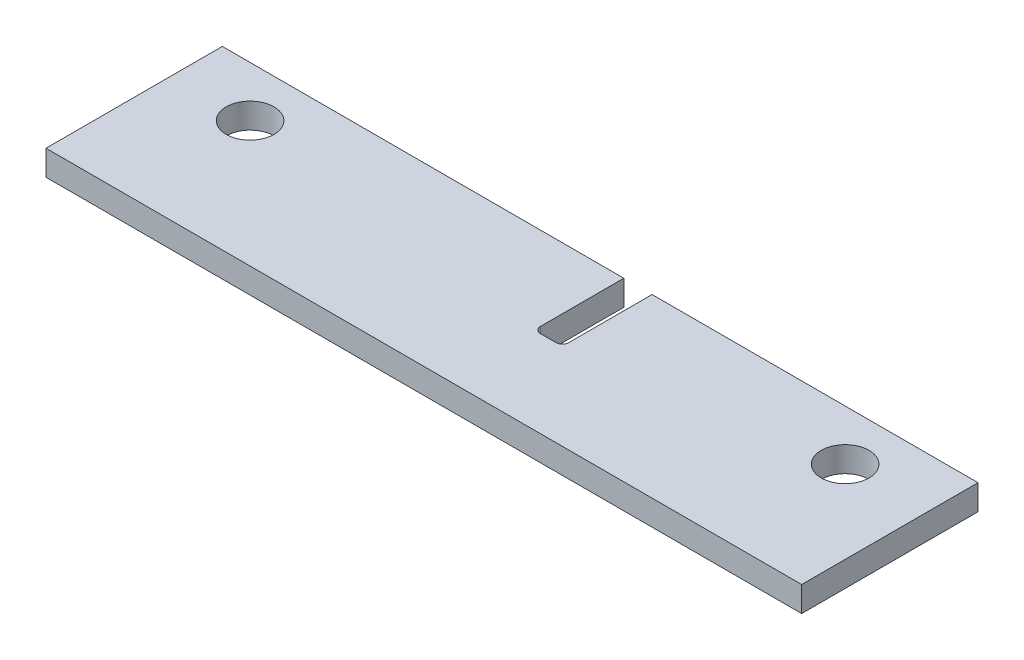
ISO-10303-21;
HEADER;
FILE_DESCRIPTION(('STEP AP214'),'2;1');
FILE_NAME('part.step','',(''),(''),'','','');
FILE_SCHEMA(('AUTOMOTIVE_DESIGN { 1 0 10303 214 1 1 1 1 }'));
ENDSEC;
DATA;
#1=APPLICATION_CONTEXT('core data for automotive mechanical design processes');
#2=APPLICATION_PROTOCOL_DEFINITION('international standard','automotive_design',2000,#1);
#3=PRODUCT_CONTEXT('',#1,'mechanical');
#4=PRODUCT('Part','Part','',(#3));
#5=PRODUCT_RELATED_PRODUCT_CATEGORY('part','',(#4));
#6=PRODUCT_DEFINITION_FORMATION('','',#4);
#7=PRODUCT_DEFINITION_CONTEXT('part definition',#1,'design');
#8=PRODUCT_DEFINITION('design','',#6,#7);
#9=PRODUCT_DEFINITION_SHAPE('','',#8);
#10=(LENGTH_UNIT() NAMED_UNIT(*) SI_UNIT(.MILLI.,.METRE.));
#11=(NAMED_UNIT(*) PLANE_ANGLE_UNIT() SI_UNIT($,.RADIAN.));
#12=(NAMED_UNIT(*) SI_UNIT($,.STERADIAN.) SOLID_ANGLE_UNIT());
#13=UNCERTAINTY_MEASURE_WITH_UNIT(LENGTH_MEASURE(1.E-05),#10,'distance_accuracy_value','');
#14=(GEOMETRIC_REPRESENTATION_CONTEXT(3) GLOBAL_UNCERTAINTY_ASSIGNED_CONTEXT((#13)) GLOBAL_UNIT_ASSIGNED_CONTEXT((#10,
#11,#12)) REPRESENTATION_CONTEXT('',''));
#15=CARTESIAN_POINT('',(0.,0.,0.));
#16=DIRECTION('',(0.,0.,1.));
#17=DIRECTION('',(1.,0.,0.));
#18=AXIS2_PLACEMENT_3D('',#15,#16,#17);
#19=CARTESIAN_POINT('',(0.,0.,249.6));
#20=DIRECTION('',(0.,0.,-1.));
#21=DIRECTION('',(-1.,0.,0.));
#22=AXIS2_PLACEMENT_3D('',#19,#20,#21);
#23=PLANE('',#22);
#24=DIRECTION('',(0.,1.,0.));
#25=VECTOR('',#24,1.);
#26=CARTESIAN_POINT('',(2477.262,115.8,249.6));
#27=LINE('',#26,#25);
#28=CARTESIAN_POINT('',(2477.262,115.8,249.6));
#29=VERTEX_POINT('',#28);
#30=CARTESIAN_POINT('',(2477.262,128.5,249.6));
#31=VERTEX_POINT('',#30);
#32=EDGE_CURVE('E155',#29,#31,#27,.T.);
#33=ORIENTED_EDGE('',*,*,#32,.T.);
#34=DIRECTION('',(-1.,0.,0.));
#35=VECTOR('',#34,1.);
#36=CARTESIAN_POINT('',(2260.6,128.5,249.6));
#37=LINE('',#36,#35);
#38=CARTESIAN_POINT('',(2641.6,128.5,249.6));
#39=VERTEX_POINT('',#38);
#40=EDGE_CURVE('E133',#39,#31,#37,.T.);
#41=ORIENTED_EDGE('',*,*,#40,.F.);
#42=DIRECTION('',(0.,1.,0.));
#43=VECTOR('',#42,1.);
#44=CARTESIAN_POINT('',(2641.6,115.8,249.6));
#45=LINE('',#44,#43);
#46=CARTESIAN_POINT('',(2641.6,115.8,249.6));
#47=VERTEX_POINT('',#46);
#48=EDGE_CURVE('E180',#47,#39,#45,.T.);
#49=ORIENTED_EDGE('',*,*,#48,.F.);
#50=DIRECTION('',(1.,0.,0.));
#51=VECTOR('',#50,1.);
#52=CARTESIAN_POINT('',(2260.6,115.8,249.6));
#53=LINE('',#52,#51);
#54=EDGE_CURVE('E206',#29,#47,#53,.T.);
#55=ORIENTED_EDGE('',*,*,#54,.F.);
#56=EDGE_LOOP('',(#33,#41,#49,#55));
#57=FACE_BOUND('',#56,.T.);
#58=ADVANCED_FACE('F44',(#57),#23,.T.);
#59=CARTESIAN_POINT('',(2260.6,115.8,249.6));
#60=DIRECTION('',(-1.,0.,0.));
#61=DIRECTION('',(0.,0.,1.));
#62=AXIS2_PLACEMENT_3D('',#59,#60,#61);
#63=PLANE('',#62);
#64=DIRECTION('',(0.,0.,1.));
#65=VECTOR('',#64,1.);
#66=CARTESIAN_POINT('',(2260.6,115.8,249.6));
#67=LINE('',#66,#65);
#68=CARTESIAN_POINT('',(2260.6,115.8,249.6));
#69=VERTEX_POINT('',#68);
#70=CARTESIAN_POINT('',(2260.6,115.8,338.5));
#71=VERTEX_POINT('',#70);
#72=EDGE_CURVE('E149',#69,#71,#67,.T.);
#73=ORIENTED_EDGE('',*,*,#72,.T.);
#74=DIRECTION('',(0.,-1.,0.));
#75=VECTOR('',#74,1.);
#76=CARTESIAN_POINT('',(2260.6,115.8,338.5));
#77=LINE('',#76,#75);
#78=CARTESIAN_POINT('',(2260.6,128.5,338.5));
#79=VERTEX_POINT('',#78);
#80=EDGE_CURVE('E140',#79,#71,#77,.T.);
#81=ORIENTED_EDGE('',*,*,#80,.F.);
#82=DIRECTION('',(0.,0.,1.));
#83=VECTOR('',#82,1.);
#84=CARTESIAN_POINT('',(2260.6,128.5,249.6));
#85=LINE('',#84,#83);
#86=CARTESIAN_POINT('',(2260.6,128.5,249.6));
#87=VERTEX_POINT('',#86);
#88=EDGE_CURVE('E124',#87,#79,#85,.T.);
#89=ORIENTED_EDGE('',*,*,#88,.F.);
#90=DIRECTION('',(0.,-1.,0.));
#91=VECTOR('',#90,1.);
#92=CARTESIAN_POINT('',(2260.6,115.8,249.6));
#93=LINE('',#92,#91);
#94=EDGE_CURVE('E138',#87,#69,#93,.T.);
#95=ORIENTED_EDGE('',*,*,#94,.T.);
#96=EDGE_LOOP('',(#73,#81,#89,#95));
#97=FACE_BOUND('',#96,.T.);
#98=ADVANCED_FACE('F137',(#97),#63,.T.);
#99=CARTESIAN_POINT('',(2260.6,128.5,249.6));
#100=DIRECTION('',(0.,1.,0.));
#101=DIRECTION('',(0.,0.,1.));
#102=AXIS2_PLACEMENT_3D('',#99,#100,#101);
#103=PLANE('',#102);
#104=CARTESIAN_POINT('',(2599.99999999996,128.5,275.));
#105=DIRECTION('',(0.,1.,0.));
#106=DIRECTION('',(0.,0.,1.));
#107=AXIS2_PLACEMENT_3D('',#104,#105,#106);
#108=CIRCLE('',#107,12.0649999999999);
#109=CARTESIAN_POINT('',(2599.99999999996,128.5,262.935));
#110=VERTEX_POINT('',#109);
#111=EDGE_CURVE('E148',#110,#110,#108,.F.);
#112=ORIENTED_EDGE('',*,*,#111,.T.);
#113=EDGE_LOOP('',(#112));
#114=FACE_BOUND('',#113,.T.);
#115=CARTESIAN_POINT('',(2299.99999999996,128.5,275.));
#116=DIRECTION('',(0.,1.,0.));
#117=DIRECTION('',(0.,0.,1.));
#118=AXIS2_PLACEMENT_3D('',#115,#116,#117);
#119=CIRCLE('',#118,12.0649999999999);
#120=CARTESIAN_POINT('',(2299.99999999996,128.5,262.935));
#121=VERTEX_POINT('',#120);
#122=EDGE_CURVE('E131',#121,#121,#119,.F.);
#123=ORIENTED_EDGE('',*,*,#122,.T.);
#124=EDGE_LOOP('',(#123));
#125=FACE_BOUND('',#124,.T.);
#126=DIRECTION('',(0.,0.,-1.));
#127=VECTOR('',#126,1.);
#128=CARTESIAN_POINT('',(2477.262,128.5,249.6));
#129=LINE('',#128,#127);
#130=CARTESIAN_POINT('',(2477.262,128.5,291.637));
#131=VERTEX_POINT('',#130);
#132=EDGE_CURVE('E163',#131,#31,#129,.T.);
#133=ORIENTED_EDGE('',*,*,#132,.F.);
#134=CARTESIAN_POINT('',(2474.087,128.5,291.637));
#135=DIRECTION('',(0.,1.,0.));
#136=DIRECTION('',(0.,0.,1.));
#137=AXIS2_PLACEMENT_3D('',#134,#135,#136);
#138=CIRCLE('',#137,3.175);
#139=CARTESIAN_POINT('',(2474.087,128.5,294.812));
#140=VERTEX_POINT('',#139);
#141=EDGE_CURVE('E224',#131,#140,#138,.F.);
#142=ORIENTED_EDGE('',*,*,#141,.T.);
#143=DIRECTION('',(1.,0.,0.));
#144=VECTOR('',#143,1.);
#145=CARTESIAN_POINT('',(2260.6,128.5,294.812000000001));
#146=LINE('',#145,#144);
#147=CARTESIAN_POINT('',(2466.213,128.5,294.812));
#148=VERTEX_POINT('',#147);
#149=EDGE_CURVE('E188',#148,#140,#146,.T.);
#150=ORIENTED_EDGE('',*,*,#149,.F.);
#151=CARTESIAN_POINT('',(2466.213,128.5,291.637));
#152=DIRECTION('',(0.,1.,0.));
#153=DIRECTION('',(0.,0.,1.));
#154=AXIS2_PLACEMENT_3D('',#151,#152,#153);
#155=CIRCLE('',#154,3.175);
#156=CARTESIAN_POINT('',(2463.038,128.5,291.637));
#157=VERTEX_POINT('',#156);
#158=EDGE_CURVE('E53',#148,#157,#155,.F.);
#159=ORIENTED_EDGE('',*,*,#158,.T.);
#160=DIRECTION('',(0.,0.,1.));
#161=VECTOR('',#160,1.);
#162=CARTESIAN_POINT('',(2463.038,128.5,249.6));
#163=LINE('',#162,#161);
#164=CARTESIAN_POINT('',(2463.038,128.5,249.6));
#165=VERTEX_POINT('',#164);
#166=EDGE_CURVE('E126',#165,#157,#163,.T.);
#167=ORIENTED_EDGE('',*,*,#166,.F.);
#168=EDGE_CURVE('E119',#165,#87,#37,.T.);
#169=ORIENTED_EDGE('',*,*,#168,.T.);
#170=ORIENTED_EDGE('',*,*,#88,.T.);
#171=DIRECTION('',(-1.,0.,0.));
#172=VECTOR('',#171,1.);
#173=CARTESIAN_POINT('',(2260.6,128.5,338.5));
#174=LINE('',#173,#172);
#175=CARTESIAN_POINT('',(2641.6,128.5,338.5));
#176=VERTEX_POINT('',#175);
#177=EDGE_CURVE('E160',#176,#79,#174,.T.);
#178=ORIENTED_EDGE('',*,*,#177,.F.);
#179=DIRECTION('',(0.,0.,1.));
#180=VECTOR('',#179,1.);
#181=CARTESIAN_POINT('',(2641.6,128.5,249.6));
#182=LINE('',#181,#180);
#183=EDGE_CURVE('E238',#39,#176,#182,.T.);
#184=ORIENTED_EDGE('',*,*,#183,.F.);
#185=ORIENTED_EDGE('',*,*,#40,.T.);
#186=EDGE_LOOP('',(#133,#142,#150,#159,#167,#169,#170,#178,#184,#185));
#187=FACE_BOUND('',#186,.T.);
#188=ADVANCED_FACE('F122',(#114,#125,#187),#103,.T.);
#189=CARTESIAN_POINT('',(2641.6,115.8,249.6));
#190=DIRECTION('',(1.,0.,0.));
#191=DIRECTION('',(0.,0.,-1.));
#192=AXIS2_PLACEMENT_3D('',#189,#190,#191);
#193=PLANE('',#192);
#194=ORIENTED_EDGE('',*,*,#183,.T.);
#195=DIRECTION('',(0.,1.,0.));
#196=VECTOR('',#195,1.);
#197=CARTESIAN_POINT('',(2641.6,115.8,338.5));
#198=LINE('',#197,#196);
#199=CARTESIAN_POINT('',(2641.6,115.8,338.5));
#200=VERTEX_POINT('',#199);
#201=EDGE_CURVE('E164',#200,#176,#198,.T.);
#202=ORIENTED_EDGE('',*,*,#201,.F.);
#203=DIRECTION('',(0.,0.,1.));
#204=VECTOR('',#203,1.);
#205=CARTESIAN_POINT('',(2641.6,115.8,249.6));
#206=LINE('',#205,#204);
#207=EDGE_CURVE('E232',#47,#200,#206,.T.);
#208=ORIENTED_EDGE('',*,*,#207,.F.);
#209=ORIENTED_EDGE('',*,*,#48,.T.);
#210=EDGE_LOOP('',(#194,#202,#208,#209));
#211=FACE_BOUND('',#210,.T.);
#212=ADVANCED_FACE('F291',(#211),#193,.T.);
#213=CARTESIAN_POINT('',(2260.6,115.8,249.6));
#214=DIRECTION('',(0.,-1.,0.));
#215=DIRECTION('',(0.,0.,-1.));
#216=AXIS2_PLACEMENT_3D('',#213,#214,#215);
#217=PLANE('',#216);
#218=CARTESIAN_POINT('',(2599.99999999996,115.8,275.));
#219=DIRECTION('',(0.,-1.,0.));
#220=DIRECTION('',(0.,0.,-1.));
#221=AXIS2_PLACEMENT_3D('',#218,#219,#220);
#222=CIRCLE('',#221,12.0649999999999);
#223=CARTESIAN_POINT('',(2599.99999999996,115.8,262.935));
#224=VERTEX_POINT('',#223);
#225=EDGE_CURVE('E175',#224,#224,#222,.F.);
#226=ORIENTED_EDGE('',*,*,#225,.T.);
#227=EDGE_LOOP('',(#226));
#228=FACE_BOUND('',#227,.T.);
#229=CARTESIAN_POINT('',(2299.99999999996,115.8,275.));
#230=DIRECTION('',(0.,-1.,0.));
#231=DIRECTION('',(0.,0.,-1.));
#232=AXIS2_PLACEMENT_3D('',#229,#230,#231);
#233=CIRCLE('',#232,12.0649999999999);
#234=CARTESIAN_POINT('',(2299.99999999996,115.8,262.935));
#235=VERTEX_POINT('',#234);
#236=EDGE_CURVE('E179',#235,#235,#233,.F.);
#237=ORIENTED_EDGE('',*,*,#236,.T.);
#238=EDGE_LOOP('',(#237));
#239=FACE_BOUND('',#238,.T.);
#240=DIRECTION('',(1.,0.,0.));
#241=VECTOR('',#240,1.);
#242=CARTESIAN_POINT('',(2476.5,115.8,294.812));
#243=LINE('',#242,#241);
#244=CARTESIAN_POINT('',(2466.213,115.8,294.812));
#245=VERTEX_POINT('',#244);
#246=CARTESIAN_POINT('',(2474.087,115.8,294.812));
#247=VERTEX_POINT('',#246);
#248=EDGE_CURVE('E173',#245,#247,#243,.T.);
#249=ORIENTED_EDGE('',*,*,#248,.T.);
#250=CARTESIAN_POINT('',(2474.087,115.8,291.637));
#251=DIRECTION('',(0.,-1.,0.));
#252=DIRECTION('',(0.,0.,-1.));
#253=AXIS2_PLACEMENT_3D('',#250,#251,#252);
#254=CIRCLE('',#253,3.175);
#255=CARTESIAN_POINT('',(2477.262,115.8,291.637));
#256=VERTEX_POINT('',#255);
#257=EDGE_CURVE('E227',#247,#256,#254,.F.);
#258=ORIENTED_EDGE('',*,*,#257,.T.);
#259=DIRECTION('',(0.,0.,-1.));
#260=VECTOR('',#259,1.);
#261=CARTESIAN_POINT('',(2477.262,115.8,249.6));
#262=LINE('',#261,#260);
#263=EDGE_CURVE('E187',#256,#29,#262,.T.);
#264=ORIENTED_EDGE('',*,*,#263,.T.);
#265=ORIENTED_EDGE('',*,*,#54,.T.);
#266=ORIENTED_EDGE('',*,*,#207,.T.);
#267=DIRECTION('',(1.,0.,0.));
#268=VECTOR('',#267,1.);
#269=CARTESIAN_POINT('',(2260.6,115.8,338.5));
#270=LINE('',#269,#268);
#271=EDGE_CURVE('E168',#71,#200,#270,.T.);
#272=ORIENTED_EDGE('',*,*,#271,.F.);
#273=ORIENTED_EDGE('',*,*,#72,.F.);
#274=CARTESIAN_POINT('',(2463.038,115.8,249.6));
#275=VERTEX_POINT('',#274);
#276=EDGE_CURVE('E146',#69,#275,#53,.T.);
#277=ORIENTED_EDGE('',*,*,#276,.T.);
#278=DIRECTION('',(0.,0.,1.));
#279=VECTOR('',#278,1.);
#280=CARTESIAN_POINT('',(2463.038,115.8,294.05));
#281=LINE('',#280,#279);
#282=CARTESIAN_POINT('',(2463.038,115.8,291.637));
#283=VERTEX_POINT('',#282);
#284=EDGE_CURVE('E198',#275,#283,#281,.T.);
#285=ORIENTED_EDGE('',*,*,#284,.T.);
#286=CARTESIAN_POINT('',(2466.213,115.8,291.637));
#287=DIRECTION('',(0.,-1.,0.));
#288=DIRECTION('',(0.,0.,-1.));
#289=AXIS2_PLACEMENT_3D('',#286,#287,#288);
#290=CIRCLE('',#289,3.175);
#291=EDGE_CURVE('E12',#283,#245,#290,.F.);
#292=ORIENTED_EDGE('',*,*,#291,.T.);
#293=EDGE_LOOP('',(#249,#258,#264,#265,#266,#272,#273,#277,#285,#292));
#294=FACE_BOUND('',#293,.T.);
#295=ADVANCED_FACE('F262',(#228,#239,#294),#217,.T.);
#296=DIRECTION('',(0.,1.,0.));
#297=VECTOR('',#296,1.);
#298=CARTESIAN_POINT('',(2463.038,0.,249.6));
#299=LINE('',#298,#297);
#300=EDGE_CURVE('E194',#275,#165,#299,.T.);
#301=ORIENTED_EDGE('',*,*,#300,.F.);
#302=ORIENTED_EDGE('',*,*,#276,.F.);
#303=ORIENTED_EDGE('',*,*,#94,.F.);
#304=ORIENTED_EDGE('',*,*,#168,.F.);
#305=EDGE_LOOP('',(#301,#302,#303,#304));
#306=FACE_BOUND('',#305,.T.);
#307=ADVANCED_FACE('F144',(#306),#23,.T.);
#308=CARTESIAN_POINT('',(0.,0.,338.5));
#309=DIRECTION('',(0.,0.,-1.));
#310=DIRECTION('',(-1.,0.,0.));
#311=AXIS2_PLACEMENT_3D('',#308,#309,#310);
#312=PLANE('',#311);
#313=ORIENTED_EDGE('',*,*,#80,.T.);
#314=ORIENTED_EDGE('',*,*,#271,.T.);
#315=ORIENTED_EDGE('',*,*,#201,.T.);
#316=ORIENTED_EDGE('',*,*,#177,.T.);
#317=EDGE_LOOP('',(#313,#314,#315,#316));
#318=FACE_BOUND('',#317,.T.);
#319=ADVANCED_FACE('F285',(#318),#312,.F.);
#320=CARTESIAN_POINT('',(2477.262,115.8,249.6));
#321=DIRECTION('',(1.,0.,0.));
#322=DIRECTION('',(0.,0.,-1.));
#323=AXIS2_PLACEMENT_3D('',#320,#321,#322);
#324=PLANE('',#323);
#325=ORIENTED_EDGE('',*,*,#263,.F.);
#326=DIRECTION('',(0.,1.,0.));
#327=VECTOR('',#326,1.);
#328=CARTESIAN_POINT('',(2477.262,128.5,291.637));
#329=LINE('',#328,#327);
#330=EDGE_CURVE('E197',#256,#131,#329,.T.);
#331=ORIENTED_EDGE('',*,*,#330,.T.);
#332=ORIENTED_EDGE('',*,*,#132,.T.);
#333=ORIENTED_EDGE('',*,*,#32,.F.);
#334=EDGE_LOOP('',(#325,#331,#332,#333));
#335=FACE_BOUND('',#334,.T.);
#336=ADVANCED_FACE('F249',(#335),#324,.F.);
#337=CARTESIAN_POINT('',(2476.5,115.8,294.812));
#338=DIRECTION('',(0.,0.,1.));
#339=DIRECTION('',(1.,0.,0.));
#340=AXIS2_PLACEMENT_3D('',#337,#338,#339);
#341=PLANE('',#340);
#342=ORIENTED_EDGE('',*,*,#149,.T.);
#343=DIRECTION('',(0.,1.,0.));
#344=VECTOR('',#343,1.);
#345=CARTESIAN_POINT('',(2474.087,115.8,294.812));
#346=LINE('',#345,#344);
#347=EDGE_CURVE('E219',#140,#247,#346,.F.);
#348=ORIENTED_EDGE('',*,*,#347,.T.);
#349=ORIENTED_EDGE('',*,*,#248,.F.);
#350=DIRECTION('',(0.,1.,0.));
#351=VECTOR('',#350,1.);
#352=CARTESIAN_POINT('',(2466.213,128.5,294.812));
#353=LINE('',#352,#351);
#354=EDGE_CURVE('E215',#245,#148,#353,.T.);
#355=ORIENTED_EDGE('',*,*,#354,.T.);
#356=EDGE_LOOP('',(#342,#348,#349,#355));
#357=FACE_BOUND('',#356,.T.);
#358=ADVANCED_FACE('F256',(#357),#341,.F.);
#359=CARTESIAN_POINT('',(2463.038,115.8,294.05));
#360=DIRECTION('',(-1.,0.,0.));
#361=DIRECTION('',(0.,0.,1.));
#362=AXIS2_PLACEMENT_3D('',#359,#360,#361);
#363=PLANE('',#362);
#364=ORIENTED_EDGE('',*,*,#166,.T.);
#365=DIRECTION('',(0.,1.,0.));
#366=VECTOR('',#365,1.);
#367=CARTESIAN_POINT('',(2463.038,115.8,291.637));
#368=LINE('',#367,#366);
#369=EDGE_CURVE('E60',#157,#283,#368,.F.);
#370=ORIENTED_EDGE('',*,*,#369,.T.);
#371=ORIENTED_EDGE('',*,*,#284,.F.);
#372=ORIENTED_EDGE('',*,*,#300,.T.);
#373=EDGE_LOOP('',(#364,#370,#371,#372));
#374=FACE_BOUND('',#373,.T.);
#375=ADVANCED_FACE('F263',(#374),#363,.F.);
#376=CARTESIAN_POINT('',(2299.99999999996,181.249999999996,275.));
#377=DIRECTION('',(0.,-1.,0.));
#378=DIRECTION('',(0.,0.,-1.));
#379=AXIS2_PLACEMENT_3D('',#376,#377,#378);
#380=CYLINDRICAL_SURFACE('',#379,12.0649999999999);
#381=CARTESIAN_POINT('',(2299.99999999996,128.5,262.935));
#382=CARTESIAN_POINT('',(2299.99999999996,128.367708333333,262.935));
#383=CARTESIAN_POINT('',(2299.99999999996,128.235416666667,262.935));
#384=CARTESIAN_POINT('',(2299.99999999996,127.970833333333,262.935));
#385=CARTESIAN_POINT('',(2299.99999999996,127.838541666667,262.935));
#386=CARTESIAN_POINT('',(2299.99999999996,127.573958333333,262.935));
#387=CARTESIAN_POINT('',(2299.99999999996,127.441666666667,262.935));
#388=CARTESIAN_POINT('',(2299.99999999996,127.177083333333,262.935));
#389=CARTESIAN_POINT('',(2299.99999999996,127.044791666667,262.935));
#390=CARTESIAN_POINT('',(2299.99999999996,126.780208333333,262.935));
#391=CARTESIAN_POINT('',(2299.99999999996,126.647916666667,262.935));
#392=CARTESIAN_POINT('',(2299.99999999996,126.383333333333,262.935));
#393=CARTESIAN_POINT('',(2299.99999999996,126.251041666667,262.935));
#394=CARTESIAN_POINT('',(2299.99999999996,125.986458333333,262.935));
#395=CARTESIAN_POINT('',(2299.99999999996,125.854166666667,262.935));
#396=CARTESIAN_POINT('',(2299.99999999996,125.589583333333,262.935));
#397=CARTESIAN_POINT('',(2299.99999999996,125.457291666667,262.935));
#398=CARTESIAN_POINT('',(2299.99999999996,125.192708333333,262.935));
#399=CARTESIAN_POINT('',(2299.99999999996,125.060416666667,262.935));
#400=CARTESIAN_POINT('',(2299.99999999996,124.795833333333,262.935));
#401=CARTESIAN_POINT('',(2299.99999999996,124.663541666667,262.935));
#402=CARTESIAN_POINT('',(2299.99999999996,124.398958333333,262.935));
#403=CARTESIAN_POINT('',(2299.99999999996,124.266666666667,262.935));
#404=CARTESIAN_POINT('',(2299.99999999996,124.002083333333,262.935));
#405=CARTESIAN_POINT('',(2299.99999999996,123.869791666667,262.935));
#406=CARTESIAN_POINT('',(2299.99999999996,123.605208333333,262.935));
#407=CARTESIAN_POINT('',(2299.99999999996,123.472916666667,262.935));
#408=CARTESIAN_POINT('',(2299.99999999996,123.208333333333,262.935));
#409=CARTESIAN_POINT('',(2299.99999999996,123.076041666667,262.935));
#410=CARTESIAN_POINT('',(2299.99999999996,122.811458333333,262.935));
#411=CARTESIAN_POINT('',(2299.99999999996,122.679166666667,262.935));
#412=CARTESIAN_POINT('',(2299.99999999996,122.414583333333,262.935));
#413=CARTESIAN_POINT('',(2299.99999999996,122.282291666667,262.935));
#414=CARTESIAN_POINT('',(2299.99999999996,122.017708333333,262.935));
#415=CARTESIAN_POINT('',(2299.99999999996,121.885416666667,262.935));
#416=CARTESIAN_POINT('',(2299.99999999996,121.620833333333,262.935));
#417=CARTESIAN_POINT('',(2299.99999999996,121.488541666667,262.935));
#418=CARTESIAN_POINT('',(2299.99999999996,121.223958333333,262.935));
#419=CARTESIAN_POINT('',(2299.99999999996,121.091666666667,262.935));
#420=CARTESIAN_POINT('',(2299.99999999996,120.827083333333,262.935));
#421=CARTESIAN_POINT('',(2299.99999999996,120.694791666667,262.935));
#422=CARTESIAN_POINT('',(2299.99999999996,120.430208333333,262.935));
#423=CARTESIAN_POINT('',(2299.99999999996,120.297916666667,262.935));
#424=CARTESIAN_POINT('',(2299.99999999996,120.033333333333,262.935));
#425=CARTESIAN_POINT('',(2299.99999999996,119.901041666667,262.935));
#426=CARTESIAN_POINT('',(2299.99999999996,119.636458333333,262.935));
#427=CARTESIAN_POINT('',(2299.99999999996,119.504166666667,262.935));
#428=CARTESIAN_POINT('',(2299.99999999996,119.239583333333,262.935));
#429=CARTESIAN_POINT('',(2299.99999999996,119.107291666667,262.935));
#430=CARTESIAN_POINT('',(2299.99999999996,118.842708333333,262.935));
#431=CARTESIAN_POINT('',(2299.99999999996,118.710416666667,262.935));
#432=CARTESIAN_POINT('',(2299.99999999996,118.445833333333,262.935));
#433=CARTESIAN_POINT('',(2299.99999999996,118.313541666667,262.935));
#434=CARTESIAN_POINT('',(2299.99999999996,118.048958333333,262.935));
#435=CARTESIAN_POINT('',(2299.99999999996,117.916666666667,262.935));
#436=CARTESIAN_POINT('',(2299.99999999996,117.652083333333,262.935));
#437=CARTESIAN_POINT('',(2299.99999999996,117.519791666667,262.935));
#438=CARTESIAN_POINT('',(2299.99999999996,117.255208333333,262.935));
#439=CARTESIAN_POINT('',(2299.99999999996,117.122916666667,262.935));
#440=CARTESIAN_POINT('',(2299.99999999996,116.858333333333,262.935));
#441=CARTESIAN_POINT('',(2299.99999999996,116.726041666667,262.935));
#442=CARTESIAN_POINT('',(2299.99999999996,116.461458333333,262.935));
#443=CARTESIAN_POINT('',(2299.99999999996,116.329166666667,262.935));
#444=CARTESIAN_POINT('',(2299.99999999996,116.064583333333,262.935));
#445=CARTESIAN_POINT('',(2299.99999999996,115.932291666667,262.935));
#446=CARTESIAN_POINT('',(2299.99999999996,115.8,262.935));
#447=B_SPLINE_CURVE_WITH_KNOTS('',3,(#381,#382,#383,#384,#385,#386,#387,#388,#389,#390,#391,
#392,#393,#394,#395,#396,#397,#398,#399,#400,#401,#402,#403,#404,#405,#406,#407,#408,#409,#410,
#411,#412,#413,#414,#415,#416,#417,#418,#419,#420,#421,#422,#423,#424,#425,#426,#427,#428,#429,
#430,#431,#432,#433,#434,#435,#436,#437,#438,#439,#440,#441,#442,#443,#444,#445,#446),
.UNSPECIFIED.,.F.,.F.,(4,2,2,2,2,2,2,2,2,2,2,2,2,2,2,2,2,2,2,2,2,2,2,2,2,2,2,2,2,2,2,2,4),(0.,
0.396874999999991,0.793749999999982,1.190625,1.58749999999999,1.98437499999998,2.38124999999997,
2.77812499999996,3.17499999999998,3.57187499999997,3.96874999999998,4.36562499999998,
4.76249999999998,5.15937499999998,5.55624999999998,5.95312499999998,6.34999999999997,
6.74687499999997,7.14374999999998,7.54062499999997,7.93749999999997,8.33437499999998,
8.73124999999997,9.12812499999996,9.52499999999996,9.92187499999997,10.31875,10.715625,11.1125,
11.509375,11.90625,12.303125,12.7),.UNSPECIFIED.);
#448=EDGE_CURVE('BSEAM265',#121,#235,#447,.T.);
#449=ORIENTED_EDGE('',*,*,#122,.F.);
#450=ORIENTED_EDGE('',*,*,#236,.F.);
#451=ORIENTED_EDGE('',*,*,#448,.T.);
#452=ORIENTED_EDGE('',*,*,#448,.F.);
#453=EDGE_LOOP('',(#449,#451,#450,#452));
#454=FACE_BOUND('',#453,.T.);
#455=ADVANCED_FACE('F265',(#454),#380,.F.);
#456=CARTESIAN_POINT('',(2599.99999999996,289.999999999996,275.));
#457=DIRECTION('',(0.,-1.,0.));
#458=DIRECTION('',(0.,0.,-1.));
#459=AXIS2_PLACEMENT_3D('',#456,#457,#458);
#460=CYLINDRICAL_SURFACE('',#459,12.0649999999999);
#461=CARTESIAN_POINT('',(2599.99999999996,128.5,262.935));
#462=CARTESIAN_POINT('',(2599.99999999996,128.367708333333,262.935));
#463=CARTESIAN_POINT('',(2599.99999999996,128.235416666667,262.935));
#464=CARTESIAN_POINT('',(2599.99999999996,127.970833333333,262.935));
#465=CARTESIAN_POINT('',(2599.99999999996,127.838541666667,262.935));
#466=CARTESIAN_POINT('',(2599.99999999996,127.573958333333,262.935));
#467=CARTESIAN_POINT('',(2599.99999999996,127.441666666667,262.935));
#468=CARTESIAN_POINT('',(2599.99999999996,127.177083333333,262.935));
#469=CARTESIAN_POINT('',(2599.99999999996,127.044791666667,262.935));
#470=CARTESIAN_POINT('',(2599.99999999996,126.780208333333,262.935));
#471=CARTESIAN_POINT('',(2599.99999999996,126.647916666667,262.935));
#472=CARTESIAN_POINT('',(2599.99999999996,126.383333333333,262.935));
#473=CARTESIAN_POINT('',(2599.99999999996,126.251041666667,262.935));
#474=CARTESIAN_POINT('',(2599.99999999996,125.986458333333,262.935));
#475=CARTESIAN_POINT('',(2599.99999999996,125.854166666667,262.935));
#476=CARTESIAN_POINT('',(2599.99999999996,125.589583333333,262.935));
#477=CARTESIAN_POINT('',(2599.99999999996,125.457291666667,262.935));
#478=CARTESIAN_POINT('',(2599.99999999996,125.192708333333,262.935));
#479=CARTESIAN_POINT('',(2599.99999999996,125.060416666667,262.935));
#480=CARTESIAN_POINT('',(2599.99999999996,124.795833333333,262.935));
#481=CARTESIAN_POINT('',(2599.99999999996,124.663541666667,262.935));
#482=CARTESIAN_POINT('',(2599.99999999996,124.398958333333,262.935));
#483=CARTESIAN_POINT('',(2599.99999999996,124.266666666667,262.935));
#484=CARTESIAN_POINT('',(2599.99999999996,124.002083333333,262.935));
#485=CARTESIAN_POINT('',(2599.99999999996,123.869791666667,262.935));
#486=CARTESIAN_POINT('',(2599.99999999996,123.605208333333,262.935));
#487=CARTESIAN_POINT('',(2599.99999999996,123.472916666667,262.935));
#488=CARTESIAN_POINT('',(2599.99999999996,123.208333333333,262.935));
#489=CARTESIAN_POINT('',(2599.99999999996,123.076041666667,262.935));
#490=CARTESIAN_POINT('',(2599.99999999996,122.811458333333,262.935));
#491=CARTESIAN_POINT('',(2599.99999999996,122.679166666667,262.935));
#492=CARTESIAN_POINT('',(2599.99999999996,122.414583333333,262.935));
#493=CARTESIAN_POINT('',(2599.99999999996,122.282291666667,262.935));
#494=CARTESIAN_POINT('',(2599.99999999996,122.017708333333,262.935));
#495=CARTESIAN_POINT('',(2599.99999999996,121.885416666667,262.935));
#496=CARTESIAN_POINT('',(2599.99999999996,121.620833333333,262.935));
#497=CARTESIAN_POINT('',(2599.99999999996,121.488541666667,262.935));
#498=CARTESIAN_POINT('',(2599.99999999996,121.223958333333,262.935));
#499=CARTESIAN_POINT('',(2599.99999999996,121.091666666667,262.935));
#500=CARTESIAN_POINT('',(2599.99999999996,120.827083333333,262.935));
#501=CARTESIAN_POINT('',(2599.99999999996,120.694791666667,262.935));
#502=CARTESIAN_POINT('',(2599.99999999996,120.430208333333,262.935));
#503=CARTESIAN_POINT('',(2599.99999999996,120.297916666667,262.935));
#504=CARTESIAN_POINT('',(2599.99999999996,120.033333333333,262.935));
#505=CARTESIAN_POINT('',(2599.99999999996,119.901041666667,262.935));
#506=CARTESIAN_POINT('',(2599.99999999996,119.636458333333,262.935));
#507=CARTESIAN_POINT('',(2599.99999999996,119.504166666667,262.935));
#508=CARTESIAN_POINT('',(2599.99999999996,119.239583333333,262.935));
#509=CARTESIAN_POINT('',(2599.99999999996,119.107291666667,262.935));
#510=CARTESIAN_POINT('',(2599.99999999996,118.842708333333,262.935));
#511=CARTESIAN_POINT('',(2599.99999999996,118.710416666667,262.935));
#512=CARTESIAN_POINT('',(2599.99999999996,118.445833333333,262.935));
#513=CARTESIAN_POINT('',(2599.99999999996,118.313541666667,262.935));
#514=CARTESIAN_POINT('',(2599.99999999996,118.048958333333,262.935));
#515=CARTESIAN_POINT('',(2599.99999999996,117.916666666667,262.935));
#516=CARTESIAN_POINT('',(2599.99999999996,117.652083333333,262.935));
#517=CARTESIAN_POINT('',(2599.99999999996,117.519791666667,262.935));
#518=CARTESIAN_POINT('',(2599.99999999996,117.255208333333,262.935));
#519=CARTESIAN_POINT('',(2599.99999999996,117.122916666667,262.935));
#520=CARTESIAN_POINT('',(2599.99999999996,116.858333333333,262.935));
#521=CARTESIAN_POINT('',(2599.99999999996,116.726041666667,262.935));
#522=CARTESIAN_POINT('',(2599.99999999996,116.461458333333,262.935));
#523=CARTESIAN_POINT('',(2599.99999999996,116.329166666667,262.935));
#524=CARTESIAN_POINT('',(2599.99999999996,116.064583333333,262.935));
#525=CARTESIAN_POINT('',(2599.99999999996,115.932291666667,262.935));
#526=CARTESIAN_POINT('',(2599.99999999996,115.8,262.935));
#527=B_SPLINE_CURVE_WITH_KNOTS('',3,(#461,#462,#463,#464,#465,#466,#467,#468,#469,#470,#471,
#472,#473,#474,#475,#476,#477,#478,#479,#480,#481,#482,#483,#484,#485,#486,#487,#488,#489,#490,
#491,#492,#493,#494,#495,#496,#497,#498,#499,#500,#501,#502,#503,#504,#505,#506,#507,#508,#509,
#510,#511,#512,#513,#514,#515,#516,#517,#518,#519,#520,#521,#522,#523,#524,#525,#526),
.UNSPECIFIED.,.F.,.F.,(4,2,2,2,2,2,2,2,2,2,2,2,2,2,2,2,2,2,2,2,2,2,2,2,2,2,2,2,2,2,2,2,4),(0.,
0.396874999999991,0.79375000000001,1.190625,1.58749999999999,1.98437500000001,2.38125,
2.77812499999999,3.17499999999998,3.571875,3.96874999999999,4.36562499999998,4.7625,
5.15937499999999,5.55624999999998,5.953125,6.34999999999999,6.74687499999999,7.14375,7.540625,
7.93749999999999,8.334375,8.73125,9.12812499999999,9.52500000000001,9.921875,10.31875,10.715625,
11.1125,11.509375,11.90625,12.303125,12.7),.UNSPECIFIED.);
#528=EDGE_CURVE('BSEAM271',#110,#224,#527,.T.);
#529=ORIENTED_EDGE('',*,*,#111,.F.);
#530=ORIENTED_EDGE('',*,*,#225,.F.);
#531=ORIENTED_EDGE('',*,*,#528,.T.);
#532=ORIENTED_EDGE('',*,*,#528,.F.);
#533=EDGE_LOOP('',(#529,#531,#530,#532));
#534=FACE_BOUND('',#533,.T.);
#535=ADVANCED_FACE('F271',(#534),#460,.F.);
#536=CARTESIAN_POINT('',(2474.087,115.8,291.637));
#537=DIRECTION('',(0.,-1.,0.));
#538=DIRECTION('',(0.,0.,-1.));
#539=AXIS2_PLACEMENT_3D('',#536,#537,#538);
#540=CYLINDRICAL_SURFACE('',#539,3.175);
#541=ORIENTED_EDGE('',*,*,#257,.F.);
#542=ORIENTED_EDGE('',*,*,#347,.F.);
#543=ORIENTED_EDGE('',*,*,#141,.F.);
#544=ORIENTED_EDGE('',*,*,#330,.F.);
#545=EDGE_LOOP('',(#541,#542,#543,#544));
#546=FACE_BOUND('',#545,.T.);
#547=ADVANCED_FACE('F253',(#546),#540,.F.);
#548=CARTESIAN_POINT('',(2466.213,115.8,291.637));
#549=DIRECTION('',(0.,-1.,0.));
#550=DIRECTION('',(0.,0.,-1.));
#551=AXIS2_PLACEMENT_3D('',#548,#549,#550);
#552=CYLINDRICAL_SURFACE('',#551,3.175);
#553=ORIENTED_EDGE('',*,*,#291,.F.);
#554=ORIENTED_EDGE('',*,*,#369,.F.);
#555=ORIENTED_EDGE('',*,*,#158,.F.);
#556=ORIENTED_EDGE('',*,*,#354,.F.);
#557=EDGE_LOOP('',(#553,#554,#555,#556));
#558=FACE_BOUND('',#557,.T.);
#559=ADVANCED_FACE('F46',(#558),#552,.F.);
#560=CLOSED_SHELL('',(#58,#98,#188,#212,#295,#307,#319,#336,#358,#375,#455,#535,#547,#559));
#561=MANIFOLD_SOLID_BREP('B2',#560);
#562=ADVANCED_BREP_SHAPE_REPRESENTATION('',(#18,#561),#14);
#563=SHAPE_DEFINITION_REPRESENTATION(#9,#562);
ENDSEC;
END-ISO-10303-21;
